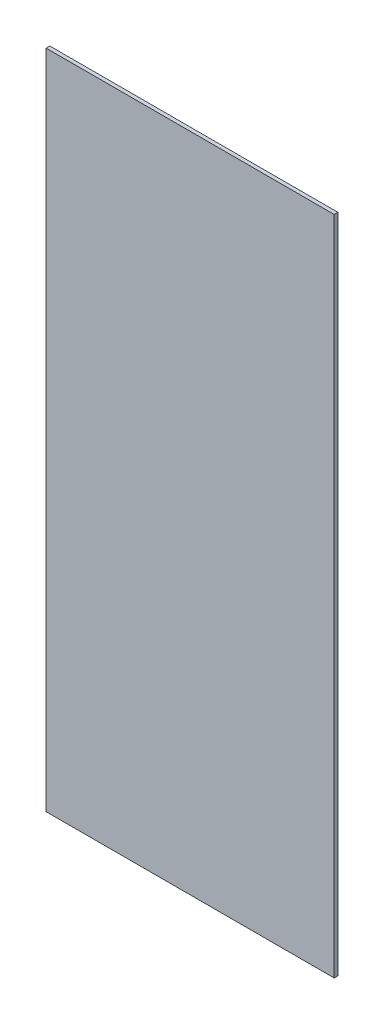
ISO-10303-21;
HEADER;
FILE_DESCRIPTION(('STEP AP214'),'2;1');
FILE_NAME('part.step','',(''),(''),'','','');
FILE_SCHEMA(('AUTOMOTIVE_DESIGN { 1 0 10303 214 1 1 1 1 }'));
ENDSEC;
DATA;
#1=APPLICATION_CONTEXT('core data for automotive mechanical design processes');
#2=APPLICATION_PROTOCOL_DEFINITION('international standard','automotive_design',2000,#1);
#3=PRODUCT_CONTEXT('',#1,'mechanical');
#4=PRODUCT('Part','Part','',(#3));
#5=PRODUCT_RELATED_PRODUCT_CATEGORY('part','',(#4));
#6=PRODUCT_DEFINITION_FORMATION('','',#4);
#7=PRODUCT_DEFINITION_CONTEXT('part definition',#1,'design');
#8=PRODUCT_DEFINITION('design','',#6,#7);
#9=PRODUCT_DEFINITION_SHAPE('','',#8);
#10=(LENGTH_UNIT() NAMED_UNIT(*) SI_UNIT(.MILLI.,.METRE.));
#11=(NAMED_UNIT(*) PLANE_ANGLE_UNIT() SI_UNIT($,.RADIAN.));
#12=(NAMED_UNIT(*) SI_UNIT($,.STERADIAN.) SOLID_ANGLE_UNIT());
#13=UNCERTAINTY_MEASURE_WITH_UNIT(LENGTH_MEASURE(1.E-05),#10,'distance_accuracy_value','');
#14=(GEOMETRIC_REPRESENTATION_CONTEXT(3) GLOBAL_UNCERTAINTY_ASSIGNED_CONTEXT((#13)) GLOBAL_UNIT_ASSIGNED_CONTEXT((#10,
#11,#12)) REPRESENTATION_CONTEXT('',''));
#15=CARTESIAN_POINT('',(0.,0.,0.));
#16=DIRECTION('',(0.,0.,1.));
#17=DIRECTION('',(1.,0.,0.));
#18=AXIS2_PLACEMENT_3D('',#15,#16,#17);
#19=CARTESIAN_POINT('',(0.,0.,3.175));
#20=DIRECTION('',(1.,0.,0.));
#21=DIRECTION('',(0.,0.,-1.));
#22=AXIS2_PLACEMENT_3D('',#19,#20,#21);
#23=PLANE('',#22);
#24=DIRECTION('',(0.,-1.,0.));
#25=VECTOR('',#24,1.);
#26=CARTESIAN_POINT('',(0.,0.,0.));
#27=LINE('',#26,#25);
#28=CARTESIAN_POINT('',(0.,571.5,0.));
#29=VERTEX_POINT('',#28);
#30=CARTESIAN_POINT('',(0.,0.,0.));
#31=VERTEX_POINT('',#30);
#32=EDGE_CURVE('E111',#29,#31,#27,.T.);
#33=ORIENTED_EDGE('',*,*,#32,.T.);
#34=DIRECTION('',(0.,0.,-1.));
#35=VECTOR('',#34,1.);
#36=CARTESIAN_POINT('',(0.,0.,3.175));
#37=LINE('',#36,#35);
#38=CARTESIAN_POINT('',(0.,0.,3.175));
#39=VERTEX_POINT('',#38);
#40=EDGE_CURVE('E11',#39,#31,#37,.T.);
#41=ORIENTED_EDGE('',*,*,#40,.F.);
#42=DIRECTION('',(0.,-1.,0.));
#43=VECTOR('',#42,1.);
#44=CARTESIAN_POINT('',(0.,0.,3.175));
#45=LINE('',#44,#43);
#46=CARTESIAN_POINT('',(0.,571.5,3.175));
#47=VERTEX_POINT('',#46);
#48=EDGE_CURVE('E95',#47,#39,#45,.T.);
#49=ORIENTED_EDGE('',*,*,#48,.F.);
#50=DIRECTION('',(0.,0.,-1.));
#51=VECTOR('',#50,1.);
#52=CARTESIAN_POINT('',(0.,571.5,3.175));
#53=LINE('',#52,#51);
#54=EDGE_CURVE('E107',#47,#29,#53,.T.);
#55=ORIENTED_EDGE('',*,*,#54,.T.);
#56=EDGE_LOOP('',(#33,#41,#49,#55));
#57=FACE_BOUND('',#56,.T.);
#58=ADVANCED_FACE('F43',(#57),#23,.F.);
#59=CARTESIAN_POINT('',(0.,0.,3.175));
#60=DIRECTION('',(0.,1.,0.));
#61=DIRECTION('',(0.,0.,1.));
#62=AXIS2_PLACEMENT_3D('',#59,#60,#61);
#63=PLANE('',#62);
#64=DIRECTION('',(1.,0.,0.));
#65=VECTOR('',#64,1.);
#66=CARTESIAN_POINT('',(0.,0.,0.));
#67=LINE('',#66,#65);
#68=CARTESIAN_POINT('',(248.92,0.,0.));
#69=VERTEX_POINT('',#68);
#70=EDGE_CURVE('E100',#31,#69,#67,.T.);
#71=ORIENTED_EDGE('',*,*,#70,.T.);
#72=DIRECTION('',(0.,0.,-1.));
#73=VECTOR('',#72,1.);
#74=CARTESIAN_POINT('',(248.92,0.,3.175));
#75=LINE('',#74,#73);
#76=CARTESIAN_POINT('',(248.92,0.,3.175));
#77=VERTEX_POINT('',#76);
#78=EDGE_CURVE('E52',#77,#69,#75,.T.);
#79=ORIENTED_EDGE('',*,*,#78,.F.);
#80=DIRECTION('',(1.,0.,0.));
#81=VECTOR('',#80,1.);
#82=CARTESIAN_POINT('',(0.,0.,3.175));
#83=LINE('',#82,#81);
#84=EDGE_CURVE('E90',#39,#77,#83,.T.);
#85=ORIENTED_EDGE('',*,*,#84,.F.);
#86=ORIENTED_EDGE('',*,*,#40,.T.);
#87=EDGE_LOOP('',(#71,#79,#85,#86));
#88=FACE_BOUND('',#87,.T.);
#89=ADVANCED_FACE('F99',(#88),#63,.F.);
#90=CARTESIAN_POINT('',(248.92,0.,3.175));
#91=DIRECTION('',(-1.,0.,0.));
#92=DIRECTION('',(0.,0.,1.));
#93=AXIS2_PLACEMENT_3D('',#90,#91,#92);
#94=PLANE('',#93);
#95=DIRECTION('',(0.,1.,0.));
#96=VECTOR('',#95,1.);
#97=CARTESIAN_POINT('',(248.92,0.,0.));
#98=LINE('',#97,#96);
#99=CARTESIAN_POINT('',(248.92,571.5,0.));
#100=VERTEX_POINT('',#99);
#101=EDGE_CURVE('E77',#69,#100,#98,.T.);
#102=ORIENTED_EDGE('',*,*,#101,.T.);
#103=DIRECTION('',(0.,0.,-1.));
#104=VECTOR('',#103,1.);
#105=CARTESIAN_POINT('',(248.92,571.5,3.175));
#106=LINE('',#105,#104);
#107=CARTESIAN_POINT('',(248.92,571.5,3.175));
#108=VERTEX_POINT('',#107);
#109=EDGE_CURVE('E102',#108,#100,#106,.T.);
#110=ORIENTED_EDGE('',*,*,#109,.F.);
#111=DIRECTION('',(0.,1.,0.));
#112=VECTOR('',#111,1.);
#113=CARTESIAN_POINT('',(248.92,0.,3.175));
#114=LINE('',#113,#112);
#115=EDGE_CURVE('E93',#77,#108,#114,.T.);
#116=ORIENTED_EDGE('',*,*,#115,.F.);
#117=ORIENTED_EDGE('',*,*,#78,.T.);
#118=EDGE_LOOP('',(#102,#110,#116,#117));
#119=FACE_BOUND('',#118,.T.);
#120=ADVANCED_FACE('F103',(#119),#94,.F.);
#121=CARTESIAN_POINT('',(0.,571.5,3.175));
#122=DIRECTION('',(0.,-1.,0.));
#123=DIRECTION('',(0.,0.,-1.));
#124=AXIS2_PLACEMENT_3D('',#121,#122,#123);
#125=PLANE('',#124);
#126=DIRECTION('',(-1.,0.,0.));
#127=VECTOR('',#126,1.);
#128=CARTESIAN_POINT('',(0.,571.5,0.));
#129=LINE('',#128,#127);
#130=EDGE_CURVE('E83',#100,#29,#129,.T.);
#131=ORIENTED_EDGE('',*,*,#130,.T.);
#132=ORIENTED_EDGE('',*,*,#54,.F.);
#133=DIRECTION('',(-1.,0.,0.));
#134=VECTOR('',#133,1.);
#135=CARTESIAN_POINT('',(0.,571.5,3.175));
#136=LINE('',#135,#134);
#137=EDGE_CURVE('E60',#108,#47,#136,.T.);
#138=ORIENTED_EDGE('',*,*,#137,.F.);
#139=ORIENTED_EDGE('',*,*,#109,.T.);
#140=EDGE_LOOP('',(#131,#132,#138,#139));
#141=FACE_BOUND('',#140,.T.);
#142=ADVANCED_FACE('F124',(#141),#125,.F.);
#143=CARTESIAN_POINT('',(0.,0.,3.175));
#144=DIRECTION('',(0.,0.,-1.));
#145=DIRECTION('',(-1.,0.,0.));
#146=AXIS2_PLACEMENT_3D('',#143,#144,#145);
#147=PLANE('',#146);
#148=ORIENTED_EDGE('',*,*,#48,.T.);
#149=ORIENTED_EDGE('',*,*,#84,.T.);
#150=ORIENTED_EDGE('',*,*,#115,.T.);
#151=ORIENTED_EDGE('',*,*,#137,.T.);
#152=EDGE_LOOP('',(#148,#149,#150,#151));
#153=FACE_BOUND('',#152,.T.);
#154=ADVANCED_FACE('F91',(#153),#147,.F.);
#155=CARTESIAN_POINT('',(0.,0.,0.));
#156=DIRECTION('',(0.,0.,-1.));
#157=DIRECTION('',(-1.,0.,0.));
#158=AXIS2_PLACEMENT_3D('',#155,#156,#157);
#159=PLANE('',#158);
#160=ORIENTED_EDGE('',*,*,#32,.F.);
#161=ORIENTED_EDGE('',*,*,#130,.F.);
#162=ORIENTED_EDGE('',*,*,#101,.F.);
#163=ORIENTED_EDGE('',*,*,#70,.F.);
#164=EDGE_LOOP('',(#160,#161,#162,#163));
#165=FACE_BOUND('',#164,.T.);
#166=ADVANCED_FACE('F127',(#165),#159,.T.);
#167=CLOSED_SHELL('',(#58,#89,#120,#142,#154,#166));
#168=MANIFOLD_SOLID_BREP('B2',#167);
#169=ADVANCED_BREP_SHAPE_REPRESENTATION('',(#18,#168),#14);
#170=SHAPE_DEFINITION_REPRESENTATION(#9,#169);
ENDSEC;
END-ISO-10303-21;
